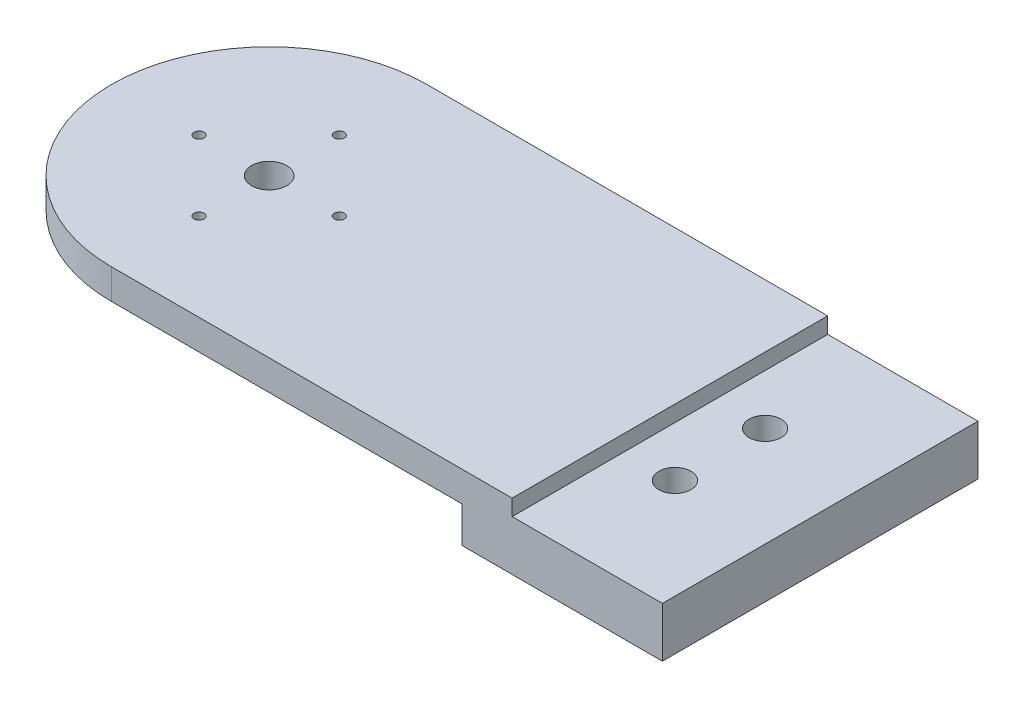
ISO-10303-21;
HEADER;
FILE_DESCRIPTION(('STEP AP214'),'2;1');
FILE_NAME('part.step','',(''),(''),'','','');
FILE_SCHEMA(('AUTOMOTIVE_DESIGN { 1 0 10303 214 1 1 1 1 }'));
ENDSEC;
DATA;
#1=APPLICATION_CONTEXT('core data for automotive mechanical design processes');
#2=APPLICATION_PROTOCOL_DEFINITION('international standard','automotive_design',2000,#1);
#3=PRODUCT_CONTEXT('',#1,'mechanical');
#4=PRODUCT('Part','Part','',(#3));
#5=PRODUCT_RELATED_PRODUCT_CATEGORY('part','',(#4));
#6=PRODUCT_DEFINITION_FORMATION('','',#4);
#7=PRODUCT_DEFINITION_CONTEXT('part definition',#1,'design');
#8=PRODUCT_DEFINITION('design','',#6,#7);
#9=PRODUCT_DEFINITION_SHAPE('','',#8);
#10=(LENGTH_UNIT() NAMED_UNIT(*) SI_UNIT(.MILLI.,.METRE.));
#11=(NAMED_UNIT(*) PLANE_ANGLE_UNIT() SI_UNIT($,.RADIAN.));
#12=(NAMED_UNIT(*) SI_UNIT($,.STERADIAN.) SOLID_ANGLE_UNIT());
#13=UNCERTAINTY_MEASURE_WITH_UNIT(LENGTH_MEASURE(1.E-05),#10,'distance_accuracy_value','');
#14=(GEOMETRIC_REPRESENTATION_CONTEXT(3) GLOBAL_UNCERTAINTY_ASSIGNED_CONTEXT((#13)) GLOBAL_UNIT_ASSIGNED_CONTEXT((#10,
#11,#12)) REPRESENTATION_CONTEXT('',''));
#15=CARTESIAN_POINT('',(0.,0.,0.));
#16=DIRECTION('',(0.,0.,1.));
#17=DIRECTION('',(1.,0.,0.));
#18=AXIS2_PLACEMENT_3D('',#15,#16,#17);
#19=CARTESIAN_POINT('',(0.,3.,0.));
#20=DIRECTION('',(0.,-1.,0.));
#21=DIRECTION('',(0.,0.,-1.));
#22=AXIS2_PLACEMENT_3D('',#19,#20,#21);
#23=CYLINDRICAL_SURFACE('',#22,15.75);
#24=CARTESIAN_POINT('',(0.,1.6,0.));
#25=DIRECTION('',(0.,-1.,0.));
#26=DIRECTION('',(0.,0.,-1.));
#27=AXIS2_PLACEMENT_3D('',#24,#25,#26);
#28=CIRCLE('',#27,15.75);
#29=CARTESIAN_POINT('',(0.,1.6,15.75));
#30=VERTEX_POINT('',#29);
#31=CARTESIAN_POINT('',(0.,1.6,-15.75));
#32=VERTEX_POINT('',#31);
#33=EDGE_CURVE('E146',#30,#32,#28,.T.);
#34=ORIENTED_EDGE('',*,*,#33,.F.);
#35=DIRECTION('',(0.,-1.,0.));
#36=VECTOR('',#35,1.);
#37=CARTESIAN_POINT('',(0.,3.,15.75));
#38=LINE('',#37,#36);
#39=CARTESIAN_POINT('',(0.,4.6,15.75));
#40=VERTEX_POINT('',#39);
#41=EDGE_CURVE('E11',#40,#30,#38,.T.);
#42=ORIENTED_EDGE('',*,*,#41,.F.);
#43=CARTESIAN_POINT('',(0.,4.6,0.));
#44=DIRECTION('',(0.,-1.,0.));
#45=DIRECTION('',(0.,0.,-1.));
#46=AXIS2_PLACEMENT_3D('',#43,#44,#45);
#47=CIRCLE('',#46,15.75);
#48=CARTESIAN_POINT('',(0.,4.6,-15.75));
#49=VERTEX_POINT('',#48);
#50=EDGE_CURVE('E115',#40,#49,#47,.T.);
#51=ORIENTED_EDGE('',*,*,#50,.T.);
#52=DIRECTION('',(0.,-1.,0.));
#53=VECTOR('',#52,1.);
#54=CARTESIAN_POINT('',(0.,3.,-15.75));
#55=LINE('',#54,#53);
#56=EDGE_CURVE('E109',#49,#32,#55,.T.);
#57=ORIENTED_EDGE('',*,*,#56,.T.);
#58=EDGE_LOOP('',(#34,#42,#51,#57));
#59=FACE_BOUND('',#58,.T.);
#60=ADVANCED_FACE('F39',(#59),#23,.T.);
#61=CARTESIAN_POINT('',(0.,3.,15.75));
#62=DIRECTION('',(0.,0.,-1.));
#63=DIRECTION('',(-1.,0.,0.));
#64=AXIS2_PLACEMENT_3D('',#61,#62,#63);
#65=PLANE('',#64);
#66=DIRECTION('',(1.,0.,0.));
#67=VECTOR('',#66,1.);
#68=CARTESIAN_POINT('',(0.,3.,15.75));
#69=LINE('',#68,#67);
#70=CARTESIAN_POINT('',(40.,3.,15.75));
#71=VERTEX_POINT('',#70);
#72=CARTESIAN_POINT('',(55.,3.,15.75));
#73=VERTEX_POINT('',#72);
#74=EDGE_CURVE('E175',#71,#73,#69,.T.);
#75=ORIENTED_EDGE('',*,*,#74,.F.);
#76=DIRECTION('',(0.,-1.,0.));
#77=VECTOR('',#76,1.);
#78=CARTESIAN_POINT('',(40.,4.6,15.75));
#79=LINE('',#78,#77);
#80=CARTESIAN_POINT('',(40.,4.6,15.75));
#81=VERTEX_POINT('',#80);
#82=EDGE_CURVE('E223',#81,#71,#79,.T.);
#83=ORIENTED_EDGE('',*,*,#82,.F.);
#84=DIRECTION('',(-1.,0.,0.));
#85=VECTOR('',#84,1.);
#86=CARTESIAN_POINT('',(35.,4.6,15.75));
#87=LINE('',#86,#85);
#88=EDGE_CURVE('E114',#81,#40,#87,.T.);
#89=ORIENTED_EDGE('',*,*,#88,.T.);
#90=ORIENTED_EDGE('',*,*,#41,.T.);
#91=DIRECTION('',(-1.,0.,0.));
#92=VECTOR('',#91,1.);
#93=CARTESIAN_POINT('',(35.,1.6,15.75));
#94=LINE('',#93,#92);
#95=CARTESIAN_POINT('',(35.,1.6,15.75));
#96=VERTEX_POINT('',#95);
#97=EDGE_CURVE('E144',#96,#30,#94,.T.);
#98=ORIENTED_EDGE('',*,*,#97,.F.);
#99=DIRECTION('',(0.,1.,0.));
#100=VECTOR('',#99,1.);
#101=CARTESIAN_POINT('',(35.,-2.,15.75));
#102=LINE('',#101,#100);
#103=CARTESIAN_POINT('',(35.,-2.,15.75));
#104=VERTEX_POINT('',#103);
#105=EDGE_CURVE('E171',#104,#96,#102,.T.);
#106=ORIENTED_EDGE('',*,*,#105,.F.);
#107=DIRECTION('',(-1.,0.,0.));
#108=VECTOR('',#107,1.);
#109=CARTESIAN_POINT('',(35.,-2.,15.75));
#110=LINE('',#109,#108);
#111=CARTESIAN_POINT('',(55.,-2.,15.75));
#112=VERTEX_POINT('',#111);
#113=EDGE_CURVE('E169',#112,#104,#110,.T.);
#114=ORIENTED_EDGE('',*,*,#113,.F.);
#115=DIRECTION('',(0.,-1.,0.));
#116=VECTOR('',#115,1.);
#117=CARTESIAN_POINT('',(55.,3.,15.75));
#118=LINE('',#117,#116);
#119=EDGE_CURVE('E47',#73,#112,#118,.T.);
#120=ORIENTED_EDGE('',*,*,#119,.F.);
#121=EDGE_LOOP('',(#75,#83,#89,#90,#98,#106,#114,#120));
#122=FACE_BOUND('',#121,.T.);
#123=ADVANCED_FACE('F225',(#122),#65,.F.);
#124=CARTESIAN_POINT('',(55.,3.,15.75));
#125=DIRECTION('',(-1.,0.,0.));
#126=DIRECTION('',(0.,0.,1.));
#127=AXIS2_PLACEMENT_3D('',#124,#125,#126);
#128=PLANE('',#127);
#129=ORIENTED_EDGE('',*,*,#119,.T.);
#130=DIRECTION('',(0.,0.,1.));
#131=VECTOR('',#130,1.);
#132=CARTESIAN_POINT('',(55.,-2.,15.75));
#133=LINE('',#132,#131);
#134=CARTESIAN_POINT('',(55.,-2.,-15.75));
#135=VERTEX_POINT('',#134);
#136=EDGE_CURVE('E166',#135,#112,#133,.T.);
#137=ORIENTED_EDGE('',*,*,#136,.F.);
#138=DIRECTION('',(0.,-1.,0.));
#139=VECTOR('',#138,1.);
#140=CARTESIAN_POINT('',(55.,3.,-15.75));
#141=LINE('',#140,#139);
#142=CARTESIAN_POINT('',(55.,3.,-15.75));
#143=VERTEX_POINT('',#142);
#144=EDGE_CURVE('E181',#143,#135,#141,.T.);
#145=ORIENTED_EDGE('',*,*,#144,.F.);
#146=DIRECTION('',(0.,0.,-1.));
#147=VECTOR('',#146,1.);
#148=CARTESIAN_POINT('',(55.,3.,15.75));
#149=LINE('',#148,#147);
#150=EDGE_CURVE('E177',#73,#143,#149,.T.);
#151=ORIENTED_EDGE('',*,*,#150,.F.);
#152=EDGE_LOOP('',(#129,#137,#145,#151));
#153=FACE_BOUND('',#152,.T.);
#154=ADVANCED_FACE('F234',(#153),#128,.F.);
#155=CARTESIAN_POINT('',(55.,3.,-15.75));
#156=DIRECTION('',(0.,0.,1.));
#157=DIRECTION('',(1.,0.,0.));
#158=AXIS2_PLACEMENT_3D('',#155,#156,#157);
#159=PLANE('',#158);
#160=DIRECTION('',(0.,1.,0.));
#161=VECTOR('',#160,1.);
#162=CARTESIAN_POINT('',(35.,-2.,-15.75));
#163=LINE('',#162,#161);
#164=CARTESIAN_POINT('',(35.,-2.,-15.75));
#165=VERTEX_POINT('',#164);
#166=CARTESIAN_POINT('',(35.,1.6,-15.75));
#167=VERTEX_POINT('',#166);
#168=EDGE_CURVE('E173',#165,#167,#163,.T.);
#169=ORIENTED_EDGE('',*,*,#168,.T.);
#170=DIRECTION('',(1.,0.,0.));
#171=VECTOR('',#170,1.);
#172=CARTESIAN_POINT('',(0.,1.6,-15.75));
#173=LINE('',#172,#171);
#174=EDGE_CURVE('E138',#32,#167,#173,.T.);
#175=ORIENTED_EDGE('',*,*,#174,.F.);
#176=ORIENTED_EDGE('',*,*,#56,.F.);
#177=DIRECTION('',(1.,0.,0.));
#178=VECTOR('',#177,1.);
#179=CARTESIAN_POINT('',(0.,4.6,-15.75));
#180=LINE('',#179,#178);
#181=CARTESIAN_POINT('',(40.,4.6,-15.75));
#182=VERTEX_POINT('',#181);
#183=EDGE_CURVE('E103',#49,#182,#180,.T.);
#184=ORIENTED_EDGE('',*,*,#183,.T.);
#185=DIRECTION('',(0.,1.,0.));
#186=VECTOR('',#185,1.);
#187=CARTESIAN_POINT('',(40.,4.6,-15.75));
#188=LINE('',#187,#186);
#189=CARTESIAN_POINT('',(40.,3.,-15.75));
#190=VERTEX_POINT('',#189);
#191=EDGE_CURVE('E106',#190,#182,#188,.T.);
#192=ORIENTED_EDGE('',*,*,#191,.F.);
#193=DIRECTION('',(-1.,0.,0.));
#194=VECTOR('',#193,1.);
#195=CARTESIAN_POINT('',(55.,3.,-15.75));
#196=LINE('',#195,#194);
#197=EDGE_CURVE('E55',#143,#190,#196,.T.);
#198=ORIENTED_EDGE('',*,*,#197,.F.);
#199=ORIENTED_EDGE('',*,*,#144,.T.);
#200=DIRECTION('',(1.,0.,0.));
#201=VECTOR('',#200,1.);
#202=CARTESIAN_POINT('',(35.,-2.,-15.75));
#203=LINE('',#202,#201);
#204=EDGE_CURVE('E163',#165,#135,#203,.T.);
#205=ORIENTED_EDGE('',*,*,#204,.F.);
#206=EDGE_LOOP('',(#169,#175,#176,#184,#192,#198,#199,#205));
#207=FACE_BOUND('',#206,.T.);
#208=ADVANCED_FACE('F105',(#207),#159,.F.);
#209=CARTESIAN_POINT('',(0.,3.,0.));
#210=DIRECTION('',(0.,1.,0.));
#211=DIRECTION('',(0.,0.,1.));
#212=AXIS2_PLACEMENT_3D('',#209,#210,#211);
#213=PLANE('',#212);
#214=DIRECTION('',(0.,0.,-1.));
#215=VECTOR('',#214,1.);
#216=CARTESIAN_POINT('',(40.,3.,15.75));
#217=LINE('',#216,#215);
#218=EDGE_CURVE('E59',#71,#190,#217,.T.);
#219=ORIENTED_EDGE('',*,*,#218,.F.);
#220=ORIENTED_EDGE('',*,*,#74,.T.);
#221=ORIENTED_EDGE('',*,*,#150,.T.);
#222=ORIENTED_EDGE('',*,*,#197,.T.);
#223=EDGE_LOOP('',(#219,#220,#221,#222));
#224=FACE_BOUND('',#223,.T.);
#225=CARTESIAN_POINT('',(45.0000000000004,3.,-4.49999999999967));
#226=DIRECTION('',(0.,1.,0.));
#227=DIRECTION('',(0.,0.,1.));
#228=AXIS2_PLACEMENT_3D('',#225,#226,#227);
#229=CIRCLE('',#228,1.6);
#230=CARTESIAN_POINT('',(45.0000000000004,3.,-2.89999999999967));
#231=VERTEX_POINT('',#230);
#232=EDGE_CURVE('E157',#231,#231,#229,.T.);
#233=ORIENTED_EDGE('',*,*,#232,.F.);
#234=EDGE_LOOP('',(#233));
#235=FACE_BOUND('',#234,.T.);
#236=CARTESIAN_POINT('',(45.0000000000004,3.,4.49999999999966));
#237=DIRECTION('',(0.,1.,0.));
#238=DIRECTION('',(0.,0.,1.));
#239=AXIS2_PLACEMENT_3D('',#236,#237,#238);
#240=CIRCLE('',#239,1.6);
#241=CARTESIAN_POINT('',(45.0000000000004,3.,6.09999999999966));
#242=VERTEX_POINT('',#241);
#243=EDGE_CURVE('E152',#242,#242,#240,.T.);
#244=ORIENTED_EDGE('',*,*,#243,.F.);
#245=EDGE_LOOP('',(#244));
#246=FACE_BOUND('',#245,.T.);
#247=ADVANCED_FACE('F229',(#224,#235,#246),#213,.T.);
#248=CARTESIAN_POINT('',(35.,-2.,15.75));
#249=DIRECTION('',(1.,0.,0.));
#250=DIRECTION('',(0.,0.,-1.));
#251=AXIS2_PLACEMENT_3D('',#248,#249,#250);
#252=PLANE('',#251);
#253=ORIENTED_EDGE('',*,*,#105,.T.);
#254=DIRECTION('',(0.,0.,1.));
#255=VECTOR('',#254,1.);
#256=CARTESIAN_POINT('',(35.,1.6,-15.75));
#257=LINE('',#256,#255);
#258=EDGE_CURVE('E141',#167,#96,#257,.T.);
#259=ORIENTED_EDGE('',*,*,#258,.F.);
#260=ORIENTED_EDGE('',*,*,#168,.F.);
#261=DIRECTION('',(0.,0.,-1.));
#262=VECTOR('',#261,1.);
#263=CARTESIAN_POINT('',(35.,-2.,15.75));
#264=LINE('',#263,#262);
#265=EDGE_CURVE('E160',#104,#165,#264,.T.);
#266=ORIENTED_EDGE('',*,*,#265,.F.);
#267=EDGE_LOOP('',(#253,#259,#260,#266));
#268=FACE_BOUND('',#267,.T.);
#269=ADVANCED_FACE('F242',(#268),#252,.F.);
#270=CARTESIAN_POINT('',(0.,-2.,0.));
#271=DIRECTION('',(0.,-1.,0.));
#272=DIRECTION('',(0.,0.,-1.));
#273=AXIS2_PLACEMENT_3D('',#270,#271,#272);
#274=PLANE('',#273);
#275=CARTESIAN_POINT('',(45.0000000000004,-2.,-4.49999999999967));
#276=DIRECTION('',(0.,-1.,0.));
#277=DIRECTION('',(0.,0.,-1.));
#278=AXIS2_PLACEMENT_3D('',#275,#276,#277);
#279=CIRCLE('',#278,1.6);
#280=CARTESIAN_POINT('',(45.0000000000004,-2.,-6.09999999999966));
#281=VERTEX_POINT('',#280);
#282=EDGE_CURVE('E149',#281,#281,#279,.T.);
#283=ORIENTED_EDGE('',*,*,#282,.F.);
#284=EDGE_LOOP('',(#283));
#285=FACE_BOUND('',#284,.T.);
#286=CARTESIAN_POINT('',(45.0000000000004,-2.,4.49999999999966));
#287=DIRECTION('',(0.,-1.,0.));
#288=DIRECTION('',(0.,0.,-1.));
#289=AXIS2_PLACEMENT_3D('',#286,#287,#288);
#290=CIRCLE('',#289,1.6);
#291=CARTESIAN_POINT('',(45.0000000000004,-2.,2.89999999999966));
#292=VERTEX_POINT('',#291);
#293=EDGE_CURVE('E148',#292,#292,#290,.T.);
#294=ORIENTED_EDGE('',*,*,#293,.F.);
#295=EDGE_LOOP('',(#294));
#296=FACE_BOUND('',#295,.T.);
#297=ORIENTED_EDGE('',*,*,#265,.T.);
#298=ORIENTED_EDGE('',*,*,#204,.T.);
#299=ORIENTED_EDGE('',*,*,#136,.T.);
#300=ORIENTED_EDGE('',*,*,#113,.T.);
#301=EDGE_LOOP('',(#297,#298,#299,#300));
#302=FACE_BOUND('',#301,.T.);
#303=ADVANCED_FACE('F236',(#285,#296,#302),#274,.T.);
#304=CARTESIAN_POINT('',(45.0000000000004,8.,4.49999999999966));
#305=DIRECTION('',(0.,-1.,0.));
#306=DIRECTION('',(0.,0.,-1.));
#307=AXIS2_PLACEMENT_3D('',#304,#305,#306);
#308=CYLINDRICAL_SURFACE('',#307,1.6);
#309=ORIENTED_EDGE('',*,*,#243,.T.);
#310=EDGE_LOOP('',(#309));
#311=FACE_BOUND('',#310,.T.);
#312=ORIENTED_EDGE('',*,*,#293,.T.);
#313=EDGE_LOOP('',(#312));
#314=FACE_BOUND('',#313,.T.);
#315=ADVANCED_FACE('F258',(#311,#314),#308,.F.);
#316=CARTESIAN_POINT('',(45.0000000000004,8.,-4.49999999999967));
#317=DIRECTION('',(0.,-1.,0.));
#318=DIRECTION('',(0.,0.,-1.));
#319=AXIS2_PLACEMENT_3D('',#316,#317,#318);
#320=CYLINDRICAL_SURFACE('',#319,1.6);
#321=ORIENTED_EDGE('',*,*,#232,.T.);
#322=EDGE_LOOP('',(#321));
#323=FACE_BOUND('',#322,.T.);
#324=ORIENTED_EDGE('',*,*,#282,.T.);
#325=EDGE_LOOP('',(#324));
#326=FACE_BOUND('',#325,.T.);
#327=ADVANCED_FACE('F249',(#323,#326),#320,.F.);
#328=CARTESIAN_POINT('',(0.,1.6,0.));
#329=DIRECTION('',(0.,-1.,0.));
#330=DIRECTION('',(0.,0.,-1.));
#331=AXIS2_PLACEMENT_3D('',#328,#329,#330);
#332=PLANE('',#331);
#333=CARTESIAN_POINT('',(0.,1.6,0.));
#334=DIRECTION('',(0.,-1.,0.));
#335=DIRECTION('',(0.,0.,-1.));
#336=AXIS2_PLACEMENT_3D('',#333,#334,#335);
#337=CIRCLE('',#336,10.);
#338=CARTESIAN_POINT('',(0.,1.6,-10.));
#339=VERTEX_POINT('',#338);
#340=EDGE_CURVE('E126',#339,#339,#337,.T.);
#341=ORIENTED_EDGE('',*,*,#340,.F.);
#342=EDGE_LOOP('',(#341));
#343=FACE_BOUND('',#342,.T.);
#344=ORIENTED_EDGE('',*,*,#174,.T.);
#345=ORIENTED_EDGE('',*,*,#258,.T.);
#346=ORIENTED_EDGE('',*,*,#97,.T.);
#347=ORIENTED_EDGE('',*,*,#33,.T.);
#348=EDGE_LOOP('',(#344,#345,#346,#347));
#349=FACE_BOUND('',#348,.T.);
#350=ADVANCED_FACE('F247',(#343,#349),#332,.T.);
#351=CARTESIAN_POINT('',(0.,4.6,0.));
#352=DIRECTION('',(0.,-1.,0.));
#353=DIRECTION('',(0.,0.,-1.));
#354=AXIS2_PLACEMENT_3D('',#351,#352,#353);
#355=PLANE('',#354);
#356=CARTESIAN_POINT('',(0.,4.6,7.));
#357=DIRECTION('',(0.,-1.,0.));
#358=DIRECTION('',(0.,0.,-1.));
#359=AXIS2_PLACEMENT_3D('',#356,#357,#358);
#360=CIRCLE('',#359,0.5);
#361=CARTESIAN_POINT('',(0.,4.6,6.5));
#362=VERTEX_POINT('',#361);
#363=EDGE_CURVE('E42',#362,#362,#360,.T.);
#364=ORIENTED_EDGE('',*,*,#363,.T.);
#365=EDGE_LOOP('',(#364));
#366=FACE_BOUND('',#365,.T.);
#367=CARTESIAN_POINT('',(7.,4.6,0.));
#368=DIRECTION('',(0.,-1.,0.));
#369=DIRECTION('',(0.,0.,-1.));
#370=AXIS2_PLACEMENT_3D('',#367,#368,#369);
#371=CIRCLE('',#370,0.5);
#372=CARTESIAN_POINT('',(7.,4.6,-0.5));
#373=VERTEX_POINT('',#372);
#374=EDGE_CURVE('E191',#373,#373,#371,.T.);
#375=ORIENTED_EDGE('',*,*,#374,.T.);
#376=EDGE_LOOP('',(#375));
#377=FACE_BOUND('',#376,.T.);
#378=CARTESIAN_POINT('',(0.,4.6,-7.));
#379=DIRECTION('',(0.,-1.,0.));
#380=DIRECTION('',(0.,0.,-1.));
#381=AXIS2_PLACEMENT_3D('',#378,#379,#380);
#382=CIRCLE('',#381,0.5);
#383=CARTESIAN_POINT('',(0.,4.6,-7.5));
#384=VERTEX_POINT('',#383);
#385=EDGE_CURVE('E189',#384,#384,#382,.T.);
#386=ORIENTED_EDGE('',*,*,#385,.T.);
#387=EDGE_LOOP('',(#386));
#388=FACE_BOUND('',#387,.T.);
#389=CARTESIAN_POINT('',(-7.,4.6,0.));
#390=DIRECTION('',(0.,-1.,0.));
#391=DIRECTION('',(0.,0.,-1.));
#392=AXIS2_PLACEMENT_3D('',#389,#390,#391);
#393=CIRCLE('',#392,0.500000000000001);
#394=CARTESIAN_POINT('',(-7.,4.6,-0.500000000000001));
#395=VERTEX_POINT('',#394);
#396=EDGE_CURVE('E186',#395,#395,#393,.T.);
#397=ORIENTED_EDGE('',*,*,#396,.T.);
#398=EDGE_LOOP('',(#397));
#399=FACE_BOUND('',#398,.T.);
#400=CARTESIAN_POINT('',(0.,4.6,0.));
#401=DIRECTION('',(0.,-1.,0.));
#402=DIRECTION('',(0.,0.,-1.));
#403=AXIS2_PLACEMENT_3D('',#400,#401,#402);
#404=CIRCLE('',#403,1.75);
#405=CARTESIAN_POINT('',(0.,4.6,-1.75));
#406=VERTEX_POINT('',#405);
#407=EDGE_CURVE('E134',#406,#406,#404,.T.);
#408=ORIENTED_EDGE('',*,*,#407,.T.);
#409=EDGE_LOOP('',(#408));
#410=FACE_BOUND('',#409,.T.);
#411=ORIENTED_EDGE('',*,*,#50,.F.);
#412=ORIENTED_EDGE('',*,*,#88,.F.);
#413=DIRECTION('',(0.,0.,1.));
#414=VECTOR('',#413,1.);
#415=CARTESIAN_POINT('',(40.,4.6,15.75));
#416=LINE('',#415,#414);
#417=EDGE_CURVE('E121',#182,#81,#416,.T.);
#418=ORIENTED_EDGE('',*,*,#417,.F.);
#419=ORIENTED_EDGE('',*,*,#183,.F.);
#420=EDGE_LOOP('',(#411,#412,#418,#419));
#421=FACE_BOUND('',#420,.T.);
#422=ADVANCED_FACE('F124',(#366,#377,#388,#399,#410,#421),#355,.F.);
#423=CARTESIAN_POINT('',(0.,11.6,0.));
#424=DIRECTION('',(0.,-1.,0.));
#425=DIRECTION('',(0.,0.,-1.));
#426=AXIS2_PLACEMENT_3D('',#423,#424,#425);
#427=CYLINDRICAL_SURFACE('',#426,1.75);
#428=ORIENTED_EDGE('',*,*,#407,.F.);
#429=EDGE_LOOP('',(#428));
#430=FACE_BOUND('',#429,.T.);
#431=CARTESIAN_POINT('',(0.,0.,0.));
#432=DIRECTION('',(0.,-1.,0.));
#433=DIRECTION('',(0.,0.,-1.));
#434=AXIS2_PLACEMENT_3D('',#431,#432,#433);
#435=CIRCLE('',#434,1.75);
#436=CARTESIAN_POINT('',(0.,0.,-1.75));
#437=VERTEX_POINT('',#436);
#438=EDGE_CURVE('E219',#437,#437,#435,.T.);
#439=ORIENTED_EDGE('',*,*,#438,.T.);
#440=EDGE_LOOP('',(#439));
#441=FACE_BOUND('',#440,.T.);
#442=ADVANCED_FACE('F256',(#430,#441),#427,.F.);
#443=CARTESIAN_POINT('',(-7.,11.6,0.));
#444=DIRECTION('',(0.,-1.,0.));
#445=DIRECTION('',(0.,0.,-1.));
#446=AXIS2_PLACEMENT_3D('',#443,#444,#445);
#447=CYLINDRICAL_SURFACE('',#446,0.500000000000001);
#448=ORIENTED_EDGE('',*,*,#396,.F.);
#449=EDGE_LOOP('',(#448));
#450=FACE_BOUND('',#449,.T.);
#451=CARTESIAN_POINT('',(-7.,0.,0.));
#452=DIRECTION('',(0.,-1.,0.));
#453=DIRECTION('',(0.,0.,-1.));
#454=AXIS2_PLACEMENT_3D('',#451,#452,#453);
#455=CIRCLE('',#454,0.500000000000001);
#456=CARTESIAN_POINT('',(-7.,0.,-0.500000000000001));
#457=VERTEX_POINT('',#456);
#458=EDGE_CURVE('E210',#457,#457,#455,.T.);
#459=ORIENTED_EDGE('',*,*,#458,.T.);
#460=EDGE_LOOP('',(#459));
#461=FACE_BOUND('',#460,.T.);
#462=ADVANCED_FACE('F367',(#450,#461),#447,.F.);
#463=CARTESIAN_POINT('',(0.,11.6,-7.));
#464=DIRECTION('',(0.,-1.,0.));
#465=DIRECTION('',(0.,0.,-1.));
#466=AXIS2_PLACEMENT_3D('',#463,#464,#465);
#467=CYLINDRICAL_SURFACE('',#466,0.5);
#468=ORIENTED_EDGE('',*,*,#385,.F.);
#469=EDGE_LOOP('',(#468));
#470=FACE_BOUND('',#469,.T.);
#471=CARTESIAN_POINT('',(0.,0.,-7.));
#472=DIRECTION('',(0.,-1.,0.));
#473=DIRECTION('',(0.,0.,-1.));
#474=AXIS2_PLACEMENT_3D('',#471,#472,#473);
#475=CIRCLE('',#474,0.5);
#476=CARTESIAN_POINT('',(0.,0.,-7.5));
#477=VERTEX_POINT('',#476);
#478=EDGE_CURVE('E209',#477,#477,#475,.T.);
#479=ORIENTED_EDGE('',*,*,#478,.T.);
#480=EDGE_LOOP('',(#479));
#481=FACE_BOUND('',#480,.T.);
#482=ADVANCED_FACE('F378',(#470,#481),#467,.F.);
#483=CARTESIAN_POINT('',(7.,11.6,0.));
#484=DIRECTION('',(0.,-1.,0.));
#485=DIRECTION('',(0.,0.,-1.));
#486=AXIS2_PLACEMENT_3D('',#483,#484,#485);
#487=CYLINDRICAL_SURFACE('',#486,0.5);
#488=ORIENTED_EDGE('',*,*,#374,.F.);
#489=EDGE_LOOP('',(#488));
#490=FACE_BOUND('',#489,.T.);
#491=CARTESIAN_POINT('',(7.,0.,0.));
#492=DIRECTION('',(0.,-1.,0.));
#493=DIRECTION('',(0.,0.,-1.));
#494=AXIS2_PLACEMENT_3D('',#491,#492,#493);
#495=CIRCLE('',#494,0.500000000000001);
#496=CARTESIAN_POINT('',(7.,0.,-0.500000000000001));
#497=VERTEX_POINT('',#496);
#498=EDGE_CURVE('E213',#497,#497,#495,.T.);
#499=ORIENTED_EDGE('',*,*,#498,.T.);
#500=EDGE_LOOP('',(#499));
#501=FACE_BOUND('',#500,.T.);
#502=ADVANCED_FACE('F203',(#490,#501),#487,.F.);
#503=CARTESIAN_POINT('',(0.,11.6,7.));
#504=DIRECTION('',(0.,-1.,0.));
#505=DIRECTION('',(0.,0.,-1.));
#506=AXIS2_PLACEMENT_3D('',#503,#504,#505);
#507=CYLINDRICAL_SURFACE('',#506,0.5);
#508=ORIENTED_EDGE('',*,*,#363,.F.);
#509=EDGE_LOOP('',(#508));
#510=FACE_BOUND('',#509,.T.);
#511=CARTESIAN_POINT('',(0.,0.,7.));
#512=DIRECTION('',(0.,-1.,0.));
#513=DIRECTION('',(0.,0.,-1.));
#514=AXIS2_PLACEMENT_3D('',#511,#512,#513);
#515=CIRCLE('',#514,0.5);
#516=CARTESIAN_POINT('',(0.,0.,6.5));
#517=VERTEX_POINT('',#516);
#518=EDGE_CURVE('E207',#517,#517,#515,.T.);
#519=ORIENTED_EDGE('',*,*,#518,.T.);
#520=EDGE_LOOP('',(#519));
#521=FACE_BOUND('',#520,.T.);
#522=ADVANCED_FACE('F199',(#510,#521),#507,.F.);
#523=CARTESIAN_POINT('',(0.,0.,0.));
#524=DIRECTION('',(0.,1.,0.));
#525=DIRECTION('',(0.,0.,1.));
#526=AXIS2_PLACEMENT_3D('',#523,#524,#525);
#527=CYLINDRICAL_SURFACE('',#526,10.);
#528=CARTESIAN_POINT('',(0.,0.,0.));
#529=DIRECTION('',(0.,-1.,0.));
#530=DIRECTION('',(0.,0.,-1.));
#531=AXIS2_PLACEMENT_3D('',#528,#529,#530);
#532=CIRCLE('',#531,10.);
#533=CARTESIAN_POINT('',(0.,0.,-10.));
#534=VERTEX_POINT('',#533);
#535=EDGE_CURVE('E129',#534,#534,#532,.T.);
#536=ORIENTED_EDGE('',*,*,#535,.F.);
#537=EDGE_LOOP('',(#536));
#538=FACE_BOUND('',#537,.T.);
#539=ORIENTED_EDGE('',*,*,#340,.T.);
#540=EDGE_LOOP('',(#539));
#541=FACE_BOUND('',#540,.T.);
#542=ADVANCED_FACE('F202',(#538,#541),#527,.T.);
#543=CARTESIAN_POINT('',(0.,0.,0.));
#544=DIRECTION('',(0.,-1.,0.));
#545=DIRECTION('',(0.,0.,-1.));
#546=AXIS2_PLACEMENT_3D('',#543,#544,#545);
#547=PLANE('',#546);
#548=ORIENTED_EDGE('',*,*,#498,.F.);
#549=EDGE_LOOP('',(#548));
#550=FACE_BOUND('',#549,.T.);
#551=ORIENTED_EDGE('',*,*,#478,.F.);
#552=EDGE_LOOP('',(#551));
#553=FACE_BOUND('',#552,.T.);
#554=ORIENTED_EDGE('',*,*,#518,.F.);
#555=EDGE_LOOP('',(#554));
#556=FACE_BOUND('',#555,.T.);
#557=ORIENTED_EDGE('',*,*,#458,.F.);
#558=EDGE_LOOP('',(#557));
#559=FACE_BOUND('',#558,.T.);
#560=ORIENTED_EDGE('',*,*,#438,.F.);
#561=EDGE_LOOP('',(#560));
#562=FACE_BOUND('',#561,.T.);
#563=ORIENTED_EDGE('',*,*,#535,.T.);
#564=EDGE_LOOP('',(#563));
#565=FACE_BOUND('',#564,.T.);
#566=ADVANCED_FACE('F322',(#550,#553,#556,#559,#562,#565),#547,.T.);
#567=CARTESIAN_POINT('',(40.,0.,0.));
#568=DIRECTION('',(1.,0.,0.));
#569=DIRECTION('',(0.,0.,-1.));
#570=AXIS2_PLACEMENT_3D('',#567,#568,#569);
#571=PLANE('',#570);
#572=ORIENTED_EDGE('',*,*,#82,.T.);
#573=ORIENTED_EDGE('',*,*,#218,.T.);
#574=ORIENTED_EDGE('',*,*,#191,.T.);
#575=ORIENTED_EDGE('',*,*,#417,.T.);
#576=EDGE_LOOP('',(#572,#573,#574,#575));
#577=FACE_BOUND('',#576,.T.);
#578=ADVANCED_FACE('F120',(#577),#571,.T.);
#579=CLOSED_SHELL('',(#60,#123,#154,#208,#247,#269,#303,#315,#327,#350,#422,#442,#462,#482,#502,
#522,#542,#566,#578));
#580=MANIFOLD_SOLID_BREP('B2',#579);
#581=ADVANCED_BREP_SHAPE_REPRESENTATION('',(#18,#580),#14);
#582=SHAPE_DEFINITION_REPRESENTATION(#9,#581);
ENDSEC;
END-ISO-10303-21;
